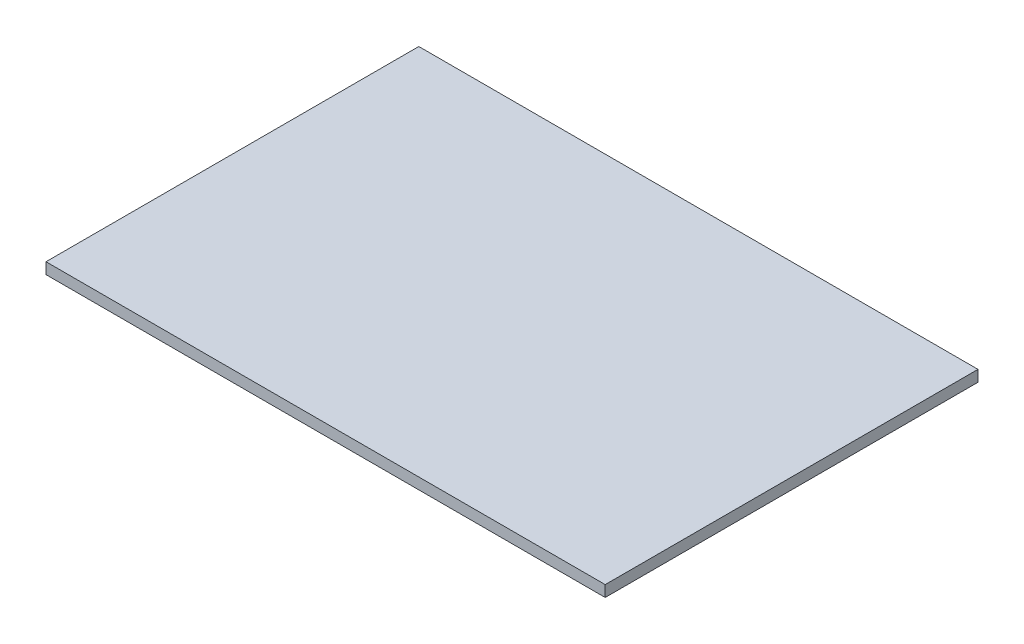
ISO-10303-21;
HEADER;
FILE_DESCRIPTION(('STEP AP214'),'2;1');
FILE_NAME('part.step','',(''),(''),'','','');
FILE_SCHEMA(('AUTOMOTIVE_DESIGN { 1 0 10303 214 1 1 1 1 }'));
ENDSEC;
DATA;
#1=APPLICATION_CONTEXT('core data for automotive mechanical design processes');
#2=APPLICATION_PROTOCOL_DEFINITION('international standard','automotive_design',2000,#1);
#3=PRODUCT_CONTEXT('',#1,'mechanical');
#4=PRODUCT('Part','Part','',(#3));
#5=PRODUCT_RELATED_PRODUCT_CATEGORY('part','',(#4));
#6=PRODUCT_DEFINITION_FORMATION('','',#4);
#7=PRODUCT_DEFINITION_CONTEXT('part definition',#1,'design');
#8=PRODUCT_DEFINITION('design','',#6,#7);
#9=PRODUCT_DEFINITION_SHAPE('','',#8);
#10=(LENGTH_UNIT() NAMED_UNIT(*) SI_UNIT(.MILLI.,.METRE.));
#11=(NAMED_UNIT(*) PLANE_ANGLE_UNIT() SI_UNIT($,.RADIAN.));
#12=(NAMED_UNIT(*) SI_UNIT($,.STERADIAN.) SOLID_ANGLE_UNIT());
#13=UNCERTAINTY_MEASURE_WITH_UNIT(LENGTH_MEASURE(1.E-05),#10,'distance_accuracy_value','');
#14=(GEOMETRIC_REPRESENTATION_CONTEXT(3) GLOBAL_UNCERTAINTY_ASSIGNED_CONTEXT((#13)) GLOBAL_UNIT_ASSIGNED_CONTEXT((#10,
#11,#12)) REPRESENTATION_CONTEXT('',''));
#15=CARTESIAN_POINT('',(0.,0.,0.));
#16=DIRECTION('',(0.,0.,1.));
#17=DIRECTION('',(1.,0.,0.));
#18=AXIS2_PLACEMENT_3D('',#15,#16,#17);
#19=CARTESIAN_POINT('',(0.,3.,0.));
#20=DIRECTION('',(1.,0.,0.));
#21=DIRECTION('',(0.,0.,-1.));
#22=AXIS2_PLACEMENT_3D('',#19,#20,#21);
#23=PLANE('',#22);
#24=DIRECTION('',(0.,0.,1.));
#25=VECTOR('',#24,1.);
#26=CARTESIAN_POINT('',(0.,0.,0.));
#27=LINE('',#26,#25);
#28=CARTESIAN_POINT('',(0.,0.,-100.));
#29=VERTEX_POINT('',#28);
#30=CARTESIAN_POINT('',(0.,0.,0.));
#31=VERTEX_POINT('',#30);
#32=EDGE_CURVE('E96',#29,#31,#27,.T.);
#33=ORIENTED_EDGE('',*,*,#32,.T.);
#34=DIRECTION('',(0.,-1.,0.));
#35=VECTOR('',#34,1.);
#36=CARTESIAN_POINT('',(0.,3.,0.));
#37=LINE('',#36,#35);
#38=CARTESIAN_POINT('',(0.,3.,0.));
#39=VERTEX_POINT('',#38);
#40=EDGE_CURVE('E11',#39,#31,#37,.T.);
#41=ORIENTED_EDGE('',*,*,#40,.F.);
#42=DIRECTION('',(0.,0.,1.));
#43=VECTOR('',#42,1.);
#44=CARTESIAN_POINT('',(0.,3.,0.));
#45=LINE('',#44,#43);
#46=CARTESIAN_POINT('',(0.,3.,-100.));
#47=VERTEX_POINT('',#46);
#48=EDGE_CURVE('E84',#47,#39,#45,.T.);
#49=ORIENTED_EDGE('',*,*,#48,.F.);
#50=DIRECTION('',(0.,-1.,0.));
#51=VECTOR('',#50,1.);
#52=CARTESIAN_POINT('',(0.,3.,-100.));
#53=LINE('',#52,#51);
#54=EDGE_CURVE('E92',#47,#29,#53,.T.);
#55=ORIENTED_EDGE('',*,*,#54,.T.);
#56=EDGE_LOOP('',(#33,#41,#49,#55));
#57=FACE_BOUND('',#56,.T.);
#58=ADVANCED_FACE('F33',(#57),#23,.F.);
#59=CARTESIAN_POINT('',(0.,3.,0.));
#60=DIRECTION('',(0.,0.,-1.));
#61=DIRECTION('',(-1.,0.,0.));
#62=AXIS2_PLACEMENT_3D('',#59,#60,#61);
#63=PLANE('',#62);
#64=DIRECTION('',(1.,0.,0.));
#65=VECTOR('',#64,1.);
#66=CARTESIAN_POINT('',(0.,0.,0.));
#67=LINE('',#66,#65);
#68=CARTESIAN_POINT('',(150.,0.,0.));
#69=VERTEX_POINT('',#68);
#70=EDGE_CURVE('E88',#31,#69,#67,.T.);
#71=ORIENTED_EDGE('',*,*,#70,.T.);
#72=DIRECTION('',(0.,-1.,0.));
#73=VECTOR('',#72,1.);
#74=CARTESIAN_POINT('',(150.,3.,0.));
#75=LINE('',#74,#73);
#76=CARTESIAN_POINT('',(150.,3.,0.));
#77=VERTEX_POINT('',#76);
#78=EDGE_CURVE('E41',#77,#69,#75,.T.);
#79=ORIENTED_EDGE('',*,*,#78,.F.);
#80=DIRECTION('',(1.,0.,0.));
#81=VECTOR('',#80,1.);
#82=CARTESIAN_POINT('',(0.,3.,0.));
#83=LINE('',#82,#81);
#84=EDGE_CURVE('E79',#39,#77,#83,.T.);
#85=ORIENTED_EDGE('',*,*,#84,.F.);
#86=ORIENTED_EDGE('',*,*,#40,.T.);
#87=EDGE_LOOP('',(#71,#79,#85,#86));
#88=FACE_BOUND('',#87,.T.);
#89=ADVANCED_FACE('F87',(#88),#63,.F.);
#90=CARTESIAN_POINT('',(150.,3.,0.));
#91=DIRECTION('',(-1.,0.,0.));
#92=DIRECTION('',(0.,0.,1.));
#93=AXIS2_PLACEMENT_3D('',#90,#91,#92);
#94=PLANE('',#93);
#95=DIRECTION('',(0.,0.,-1.));
#96=VECTOR('',#95,1.);
#97=CARTESIAN_POINT('',(150.,0.,0.));
#98=LINE('',#97,#96);
#99=CARTESIAN_POINT('',(150.,0.,-100.));
#100=VERTEX_POINT('',#99);
#101=EDGE_CURVE('E66',#69,#100,#98,.T.);
#102=ORIENTED_EDGE('',*,*,#101,.T.);
#103=DIRECTION('',(0.,-1.,0.));
#104=VECTOR('',#103,1.);
#105=CARTESIAN_POINT('',(150.,3.,-100.));
#106=LINE('',#105,#104);
#107=CARTESIAN_POINT('',(150.,3.,-100.));
#108=VERTEX_POINT('',#107);
#109=EDGE_CURVE('E89',#108,#100,#106,.T.);
#110=ORIENTED_EDGE('',*,*,#109,.F.);
#111=DIRECTION('',(0.,0.,-1.));
#112=VECTOR('',#111,1.);
#113=CARTESIAN_POINT('',(150.,3.,0.));
#114=LINE('',#113,#112);
#115=EDGE_CURVE('E82',#77,#108,#114,.T.);
#116=ORIENTED_EDGE('',*,*,#115,.F.);
#117=ORIENTED_EDGE('',*,*,#78,.T.);
#118=EDGE_LOOP('',(#102,#110,#116,#117));
#119=FACE_BOUND('',#118,.T.);
#120=ADVANCED_FACE('F90',(#119),#94,.F.);
#121=CARTESIAN_POINT('',(0.,3.,-100.));
#122=DIRECTION('',(0.,0.,1.));
#123=DIRECTION('',(1.,0.,0.));
#124=AXIS2_PLACEMENT_3D('',#121,#122,#123);
#125=PLANE('',#124);
#126=DIRECTION('',(-1.,0.,0.));
#127=VECTOR('',#126,1.);
#128=CARTESIAN_POINT('',(0.,0.,-100.));
#129=LINE('',#128,#127);
#130=EDGE_CURVE('E72',#100,#29,#129,.T.);
#131=ORIENTED_EDGE('',*,*,#130,.T.);
#132=ORIENTED_EDGE('',*,*,#54,.F.);
#133=DIRECTION('',(-1.,0.,0.));
#134=VECTOR('',#133,1.);
#135=CARTESIAN_POINT('',(0.,3.,-100.));
#136=LINE('',#135,#134);
#137=EDGE_CURVE('E49',#108,#47,#136,.T.);
#138=ORIENTED_EDGE('',*,*,#137,.F.);
#139=ORIENTED_EDGE('',*,*,#109,.T.);
#140=EDGE_LOOP('',(#131,#132,#138,#139));
#141=FACE_BOUND('',#140,.T.);
#142=ADVANCED_FACE('F103',(#141),#125,.F.);
#143=CARTESIAN_POINT('',(0.,3.,0.));
#144=DIRECTION('',(0.,-1.,0.));
#145=DIRECTION('',(0.,0.,-1.));
#146=AXIS2_PLACEMENT_3D('',#143,#144,#145);
#147=PLANE('',#146);
#148=ORIENTED_EDGE('',*,*,#48,.T.);
#149=ORIENTED_EDGE('',*,*,#84,.T.);
#150=ORIENTED_EDGE('',*,*,#115,.T.);
#151=ORIENTED_EDGE('',*,*,#137,.T.);
#152=EDGE_LOOP('',(#148,#149,#150,#151));
#153=FACE_BOUND('',#152,.T.);
#154=ADVANCED_FACE('F80',(#153),#147,.F.);
#155=CARTESIAN_POINT('',(0.,0.,0.));
#156=DIRECTION('',(0.,-1.,0.));
#157=DIRECTION('',(0.,0.,-1.));
#158=AXIS2_PLACEMENT_3D('',#155,#156,#157);
#159=PLANE('',#158);
#160=ORIENTED_EDGE('',*,*,#32,.F.);
#161=ORIENTED_EDGE('',*,*,#130,.F.);
#162=ORIENTED_EDGE('',*,*,#101,.F.);
#163=ORIENTED_EDGE('',*,*,#70,.F.);
#164=EDGE_LOOP('',(#160,#161,#162,#163));
#165=FACE_BOUND('',#164,.T.);
#166=ADVANCED_FACE('F106',(#165),#159,.T.);
#167=CLOSED_SHELL('',(#58,#89,#120,#142,#154,#166));
#168=MANIFOLD_SOLID_BREP('B2',#167);
#169=ADVANCED_BREP_SHAPE_REPRESENTATION('',(#18,#168),#14);
#170=SHAPE_DEFINITION_REPRESENTATION(#9,#169);
ENDSEC;
END-ISO-10303-21;
